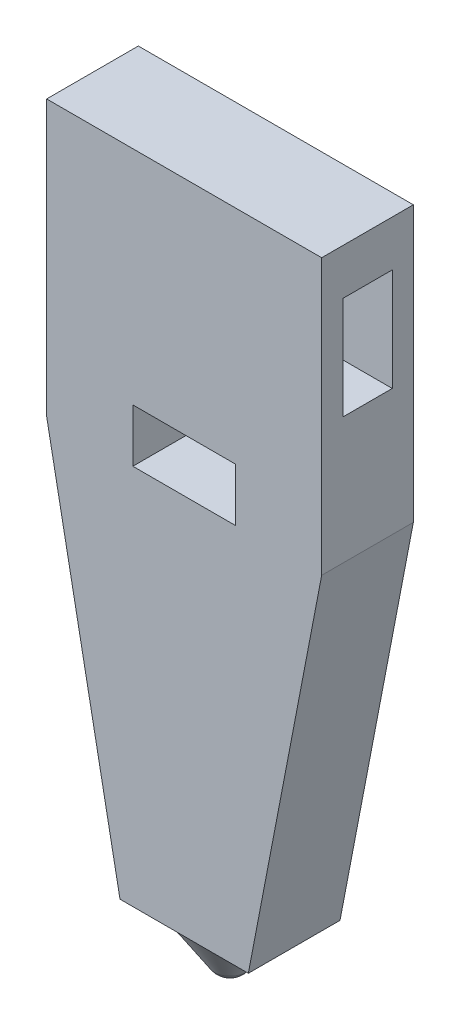
ISO-10303-21;
HEADER;
FILE_DESCRIPTION(('STEP AP214'),'2;1');
FILE_NAME('part.step','',(''),(''),'','','');
FILE_SCHEMA(('AUTOMOTIVE_DESIGN { 1 0 10303 214 1 1 1 1 }'));
ENDSEC;
DATA;
#1=APPLICATION_CONTEXT('core data for automotive mechanical design processes');
#2=APPLICATION_PROTOCOL_DEFINITION('international standard','automotive_design',2000,#1);
#3=PRODUCT_CONTEXT('',#1,'mechanical');
#4=PRODUCT('Part','Part','',(#3));
#5=PRODUCT_RELATED_PRODUCT_CATEGORY('part','',(#4));
#6=PRODUCT_DEFINITION_FORMATION('','',#4);
#7=PRODUCT_DEFINITION_CONTEXT('part definition',#1,'design');
#8=PRODUCT_DEFINITION('design','',#6,#7);
#9=PRODUCT_DEFINITION_SHAPE('','',#8);
#10=(LENGTH_UNIT() NAMED_UNIT(*) SI_UNIT(.MILLI.,.METRE.));
#11=(NAMED_UNIT(*) PLANE_ANGLE_UNIT() SI_UNIT($,.RADIAN.));
#12=(NAMED_UNIT(*) SI_UNIT($,.STERADIAN.) SOLID_ANGLE_UNIT());
#13=UNCERTAINTY_MEASURE_WITH_UNIT(LENGTH_MEASURE(1.E-05),#10,'distance_accuracy_value','');
#14=(GEOMETRIC_REPRESENTATION_CONTEXT(3) GLOBAL_UNCERTAINTY_ASSIGNED_CONTEXT((#13)) GLOBAL_UNIT_ASSIGNED_CONTEXT((#10,
#11,#12)) REPRESENTATION_CONTEXT('',''));
#15=CARTESIAN_POINT('',(0.,0.,0.));
#16=DIRECTION('',(0.,0.,1.));
#17=DIRECTION('',(1.,0.,0.));
#18=AXIS2_PLACEMENT_3D('',#15,#16,#17);
#19=CARTESIAN_POINT('',(5.08000000000001,-45.466,6.35));
#20=DIRECTION('',(0.,1.,0.));
#21=DIRECTION('',(0.,0.,1.));
#22=AXIS2_PLACEMENT_3D('',#19,#20,#21);
#23=PLANE('',#22);
#24=CARTESIAN_POINT('',(9.52500000000002,-45.466,3.175));
#25=DIRECTION('',(0.,-1.,0.));
#26=DIRECTION('',(1.,0.,0.));
#27=AXIS2_PLACEMENT_3D('',#24,#25,#26);
#28=CIRCLE('',#27,3.175);
#29=CARTESIAN_POINT('',(9.52500000000002,-45.466,6.35));
#30=VERTEX_POINT('',#29);
#31=CARTESIAN_POINT('',(9.52500000000002,-45.466,0.));
#32=VERTEX_POINT('',#31);
#33=EDGE_CURVE('E49',#30,#32,#28,.T.);
#34=ORIENTED_EDGE('',*,*,#33,.F.);
#35=DIRECTION('',(1.,0.,0.));
#36=VECTOR('',#35,1.);
#37=CARTESIAN_POINT('',(5.08000000000001,-45.466,6.35));
#38=LINE('',#37,#36);
#39=CARTESIAN_POINT('',(5.08000000000001,-45.466,6.35));
#40=VERTEX_POINT('',#39);
#41=EDGE_CURVE('E256',#40,#30,#38,.T.);
#42=ORIENTED_EDGE('',*,*,#41,.F.);
#43=DIRECTION('',(0.,0.,-1.));
#44=VECTOR('',#43,1.);
#45=CARTESIAN_POINT('',(5.08000000000001,-45.466,6.35));
#46=LINE('',#45,#44);
#47=CARTESIAN_POINT('',(5.08000000000001,-45.466,0.));
#48=VERTEX_POINT('',#47);
#49=EDGE_CURVE('E302',#40,#48,#46,.T.);
#50=ORIENTED_EDGE('',*,*,#49,.T.);
#51=DIRECTION('',(1.,0.,0.));
#52=VECTOR('',#51,1.);
#53=CARTESIAN_POINT('',(5.08000000000001,-45.466,0.));
#54=LINE('',#53,#52);
#55=EDGE_CURVE('E276',#48,#32,#54,.T.);
#56=ORIENTED_EDGE('',*,*,#55,.T.);
#57=EDGE_LOOP('',(#34,#42,#50,#56));
#58=FACE_BOUND('',#57,.T.);
#59=ADVANCED_FACE('F38',(#58),#23,.F.);
#60=CARTESIAN_POINT('',(0.,0.,6.35));
#61=DIRECTION('',(1.,0.,0.));
#62=DIRECTION('',(0.,1.,0.));
#63=AXIS2_PLACEMENT_3D('',#60,#61,#62);
#64=PLANE('',#63);
#65=DIRECTION('',(0.,0.,1.));
#66=VECTOR('',#65,1.);
#67=CARTESIAN_POINT('',(0.,-10.287,1.4605));
#68=LINE('',#67,#66);
#69=CARTESIAN_POINT('',(0.,-10.287,1.4605));
#70=VERTEX_POINT('',#69);
#71=CARTESIAN_POINT('',(0.,-10.287,4.8895));
#72=VERTEX_POINT('',#71);
#73=EDGE_CURVE('E217',#70,#72,#68,.T.);
#74=ORIENTED_EDGE('',*,*,#73,.F.);
#75=DIRECTION('',(0.,-1.,0.));
#76=VECTOR('',#75,1.);
#77=CARTESIAN_POINT('',(0.,-3.175,1.4605));
#78=LINE('',#77,#76);
#79=CARTESIAN_POINT('',(0.,-3.175,1.4605));
#80=VERTEX_POINT('',#79);
#81=EDGE_CURVE('E191',#80,#70,#78,.T.);
#82=ORIENTED_EDGE('',*,*,#81,.F.);
#83=DIRECTION('',(0.,0.,-1.));
#84=VECTOR('',#83,1.);
#85=CARTESIAN_POINT('',(0.,-3.175,1.4605));
#86=LINE('',#85,#84);
#87=CARTESIAN_POINT('',(0.,-3.175,4.8895));
#88=VERTEX_POINT('',#87);
#89=EDGE_CURVE('E202',#88,#80,#86,.T.);
#90=ORIENTED_EDGE('',*,*,#89,.F.);
#91=DIRECTION('',(0.,1.,0.));
#92=VECTOR('',#91,1.);
#93=CARTESIAN_POINT('',(0.,-3.175,4.8895));
#94=LINE('',#93,#92);
#95=EDGE_CURVE('E221',#72,#88,#94,.T.);
#96=ORIENTED_EDGE('',*,*,#95,.F.);
#97=EDGE_LOOP('',(#74,#82,#90,#96));
#98=FACE_BOUND('',#97,.T.);
#99=DIRECTION('',(0.,-1.,0.));
#100=VECTOR('',#99,1.);
#101=CARTESIAN_POINT('',(0.,0.,0.));
#102=LINE('',#101,#100);
#103=CARTESIAN_POINT('',(0.,0.,0.));
#104=VERTEX_POINT('',#103);
#105=CARTESIAN_POINT('',(0.,-19.05,0.));
#106=VERTEX_POINT('',#105);
#107=EDGE_CURVE('E246',#104,#106,#102,.T.);
#108=ORIENTED_EDGE('',*,*,#107,.T.);
#109=DIRECTION('',(0.,0.,-1.));
#110=VECTOR('',#109,1.);
#111=CARTESIAN_POINT('',(0.,-19.05,6.35));
#112=LINE('',#111,#110);
#113=CARTESIAN_POINT('',(0.,-19.05,6.35));
#114=VERTEX_POINT('',#113);
#115=EDGE_CURVE('E42',#114,#106,#112,.T.);
#116=ORIENTED_EDGE('',*,*,#115,.F.);
#117=DIRECTION('',(0.,-1.,0.));
#118=VECTOR('',#117,1.);
#119=CARTESIAN_POINT('',(0.,0.,6.35));
#120=LINE('',#119,#118);
#121=CARTESIAN_POINT('',(0.,0.,6.35));
#122=VERTEX_POINT('',#121);
#123=EDGE_CURVE('E247',#122,#114,#120,.T.);
#124=ORIENTED_EDGE('',*,*,#123,.F.);
#125=DIRECTION('',(0.,0.,-1.));
#126=VECTOR('',#125,1.);
#127=CARTESIAN_POINT('',(0.,0.,6.35));
#128=LINE('',#127,#126);
#129=EDGE_CURVE('E268',#122,#104,#128,.T.);
#130=ORIENTED_EDGE('',*,*,#129,.T.);
#131=EDGE_LOOP('',(#108,#116,#124,#130));
#132=FACE_BOUND('',#131,.T.);
#133=ADVANCED_FACE('F40',(#98,#132),#64,.F.);
#134=CARTESIAN_POINT('',(0.,-19.05,6.35));
#135=DIRECTION('',(0.982006446980647,0.188847393650125,0.));
#136=DIRECTION('',(-0.188847393650125,0.982006446980647,0.));
#137=AXIS2_PLACEMENT_3D('',#134,#135,#136);
#138=PLANE('',#137);
#139=DIRECTION('',(0.188847393650125,-0.982006446980647,0.));
#140=VECTOR('',#139,1.);
#141=CARTESIAN_POINT('',(0.,-19.05,0.));
#142=LINE('',#141,#140);
#143=EDGE_CURVE('E272',#106,#48,#142,.T.);
#144=ORIENTED_EDGE('',*,*,#143,.T.);
#145=ORIENTED_EDGE('',*,*,#49,.F.);
#146=DIRECTION('',(0.188847393650125,-0.982006446980647,0.));
#147=VECTOR('',#146,1.);
#148=CARTESIAN_POINT('',(0.,-19.05,6.35));
#149=LINE('',#148,#147);
#150=EDGE_CURVE('E251',#114,#40,#149,.T.);
#151=ORIENTED_EDGE('',*,*,#150,.F.);
#152=ORIENTED_EDGE('',*,*,#115,.T.);
#153=EDGE_LOOP('',(#144,#145,#151,#152));
#154=FACE_BOUND('',#153,.T.);
#155=ADVANCED_FACE('F313',(#154),#138,.F.);
#156=EDGE_CURVE('E11',#32,#30,#28,.T.);
#157=ORIENTED_EDGE('',*,*,#156,.F.);
#158=CARTESIAN_POINT('',(13.97,-45.466,0.));
#159=VERTEX_POINT('',#158);
#160=EDGE_CURVE('E275',#32,#159,#54,.T.);
#161=ORIENTED_EDGE('',*,*,#160,.T.);
#162=DIRECTION('',(0.,0.,-1.));
#163=VECTOR('',#162,1.);
#164=CARTESIAN_POINT('',(13.97,-45.466,6.35));
#165=LINE('',#164,#163);
#166=CARTESIAN_POINT('',(13.97,-45.466,6.35));
#167=VERTEX_POINT('',#166);
#168=EDGE_CURVE('E299',#167,#159,#165,.T.);
#169=ORIENTED_EDGE('',*,*,#168,.F.);
#170=EDGE_CURVE('E255',#30,#167,#38,.T.);
#171=ORIENTED_EDGE('',*,*,#170,.F.);
#172=EDGE_LOOP('',(#157,#161,#169,#171));
#173=FACE_BOUND('',#172,.T.);
#174=ADVANCED_FACE('F328',(#173),#23,.F.);
#175=CARTESIAN_POINT('',(13.97,-45.466,6.35));
#176=DIRECTION('',(-0.982006446980647,0.188847393650124,0.));
#177=DIRECTION('',(-0.188847393650125,-0.982006446980648,0.));
#178=AXIS2_PLACEMENT_3D('',#175,#176,#177);
#179=PLANE('',#178);
#180=DIRECTION('',(0.188847393650124,0.982006446980647,0.));
#181=VECTOR('',#180,1.);
#182=CARTESIAN_POINT('',(13.97,-45.466,0.));
#183=LINE('',#182,#181);
#184=CARTESIAN_POINT('',(19.05,-19.05,0.));
#185=VERTEX_POINT('',#184);
#186=EDGE_CURVE('E280',#159,#185,#183,.T.);
#187=ORIENTED_EDGE('',*,*,#186,.T.);
#188=DIRECTION('',(0.,0.,-1.));
#189=VECTOR('',#188,1.);
#190=CARTESIAN_POINT('',(19.05,-19.05,6.35));
#191=LINE('',#190,#189);
#192=CARTESIAN_POINT('',(19.05,-19.05,6.35));
#193=VERTEX_POINT('',#192);
#194=EDGE_CURVE('E295',#193,#185,#191,.T.);
#195=ORIENTED_EDGE('',*,*,#194,.F.);
#196=DIRECTION('',(0.188847393650124,0.982006446980647,0.));
#197=VECTOR('',#196,1.);
#198=CARTESIAN_POINT('',(13.97,-45.466,6.35));
#199=LINE('',#198,#197);
#200=EDGE_CURVE('E259',#167,#193,#199,.T.);
#201=ORIENTED_EDGE('',*,*,#200,.F.);
#202=ORIENTED_EDGE('',*,*,#168,.T.);
#203=EDGE_LOOP('',(#187,#195,#201,#202));
#204=FACE_BOUND('',#203,.T.);
#205=ADVANCED_FACE('F344',(#204),#179,.F.);
#206=CARTESIAN_POINT('',(19.05,0.,6.35));
#207=DIRECTION('',(-1.,0.,0.));
#208=DIRECTION('',(0.,-1.,0.));
#209=AXIS2_PLACEMENT_3D('',#206,#207,#208);
#210=PLANE('',#209);
#211=DIRECTION('',(0.,0.,-1.));
#212=VECTOR('',#211,1.);
#213=CARTESIAN_POINT('',(19.05,-3.175,1.4605));
#214=LINE('',#213,#212);
#215=CARTESIAN_POINT('',(19.05,-3.175,4.8895));
#216=VERTEX_POINT('',#215);
#217=CARTESIAN_POINT('',(19.05,-3.175,1.4605));
#218=VERTEX_POINT('',#217);
#219=EDGE_CURVE('E210',#216,#218,#214,.T.);
#220=ORIENTED_EDGE('',*,*,#219,.T.);
#221=DIRECTION('',(0.,-1.,0.));
#222=VECTOR('',#221,1.);
#223=CARTESIAN_POINT('',(19.05,-3.175,1.4605));
#224=LINE('',#223,#222);
#225=CARTESIAN_POINT('',(19.05,-10.287,1.4605));
#226=VERTEX_POINT('',#225);
#227=EDGE_CURVE('E197',#218,#226,#224,.T.);
#228=ORIENTED_EDGE('',*,*,#227,.T.);
#229=DIRECTION('',(0.,0.,1.));
#230=VECTOR('',#229,1.);
#231=CARTESIAN_POINT('',(19.05,-10.287,1.4605));
#232=LINE('',#231,#230);
#233=CARTESIAN_POINT('',(19.05,-10.287,4.8895));
#234=VERTEX_POINT('',#233);
#235=EDGE_CURVE('E201',#226,#234,#232,.T.);
#236=ORIENTED_EDGE('',*,*,#235,.T.);
#237=DIRECTION('',(0.,1.,0.));
#238=VECTOR('',#237,1.);
#239=CARTESIAN_POINT('',(19.05,-3.175,4.8895));
#240=LINE('',#239,#238);
#241=EDGE_CURVE('E206',#234,#216,#240,.T.);
#242=ORIENTED_EDGE('',*,*,#241,.T.);
#243=EDGE_LOOP('',(#220,#228,#236,#242));
#244=FACE_BOUND('',#243,.T.);
#245=DIRECTION('',(0.,1.,0.));
#246=VECTOR('',#245,1.);
#247=CARTESIAN_POINT('',(19.05,0.,0.));
#248=LINE('',#247,#246);
#249=CARTESIAN_POINT('',(19.05,0.,0.));
#250=VERTEX_POINT('',#249);
#251=EDGE_CURVE('E283',#185,#250,#248,.T.);
#252=ORIENTED_EDGE('',*,*,#251,.T.);
#253=DIRECTION('',(0.,0.,-1.));
#254=VECTOR('',#253,1.);
#255=CARTESIAN_POINT('',(19.05,0.,6.35));
#256=LINE('',#255,#254);
#257=CARTESIAN_POINT('',(19.05,0.,6.35));
#258=VERTEX_POINT('',#257);
#259=EDGE_CURVE('E291',#258,#250,#256,.T.);
#260=ORIENTED_EDGE('',*,*,#259,.F.);
#261=DIRECTION('',(0.,1.,0.));
#262=VECTOR('',#261,1.);
#263=CARTESIAN_POINT('',(19.05,0.,6.35));
#264=LINE('',#263,#262);
#265=EDGE_CURVE('E262',#193,#258,#264,.T.);
#266=ORIENTED_EDGE('',*,*,#265,.F.);
#267=ORIENTED_EDGE('',*,*,#194,.T.);
#268=EDGE_LOOP('',(#252,#260,#266,#267));
#269=FACE_BOUND('',#268,.T.);
#270=ADVANCED_FACE('F342',(#244,#269),#210,.F.);
#271=CARTESIAN_POINT('',(0.,0.,6.35));
#272=DIRECTION('',(0.,-1.,0.));
#273=DIRECTION('',(1.,0.,0.));
#274=AXIS2_PLACEMENT_3D('',#271,#272,#273);
#275=PLANE('',#274);
#276=DIRECTION('',(-1.,0.,0.));
#277=VECTOR('',#276,1.);
#278=CARTESIAN_POINT('',(0.,0.,0.));
#279=LINE('',#278,#277);
#280=EDGE_CURVE('E252',#250,#104,#279,.T.);
#281=ORIENTED_EDGE('',*,*,#280,.T.);
#282=ORIENTED_EDGE('',*,*,#129,.F.);
#283=DIRECTION('',(-1.,0.,0.));
#284=VECTOR('',#283,1.);
#285=CARTESIAN_POINT('',(0.,0.,6.35));
#286=LINE('',#285,#284);
#287=EDGE_CURVE('E265',#258,#122,#286,.T.);
#288=ORIENTED_EDGE('',*,*,#287,.F.);
#289=ORIENTED_EDGE('',*,*,#259,.T.);
#290=EDGE_LOOP('',(#281,#282,#288,#289));
#291=FACE_BOUND('',#290,.T.);
#292=ADVANCED_FACE('F340',(#291),#275,.F.);
#293=CARTESIAN_POINT('',(0.,0.,6.35));
#294=DIRECTION('',(0.,0.,1.));
#295=DIRECTION('',(1.,0.,0.));
#296=AXIS2_PLACEMENT_3D('',#293,#294,#295);
#297=PLANE('',#296);
#298=DIRECTION('',(0.,-1.,0.));
#299=VECTOR('',#298,1.);
#300=CARTESIAN_POINT('',(5.969,-19.05,6.35));
#301=LINE('',#300,#299);
#302=CARTESIAN_POINT('',(5.969,-15.367,6.35));
#303=VERTEX_POINT('',#302);
#304=CARTESIAN_POINT('',(5.969,-19.05,6.35));
#305=VERTEX_POINT('',#304);
#306=EDGE_CURVE('E56',#303,#305,#301,.T.);
#307=ORIENTED_EDGE('',*,*,#306,.F.);
#308=DIRECTION('',(-1.,0.,0.));
#309=VECTOR('',#308,1.);
#310=CARTESIAN_POINT('',(5.969,-15.367,6.35));
#311=LINE('',#310,#309);
#312=CARTESIAN_POINT('',(13.081,-15.367,6.35));
#313=VERTEX_POINT('',#312);
#314=EDGE_CURVE('E169',#313,#303,#311,.T.);
#315=ORIENTED_EDGE('',*,*,#314,.F.);
#316=DIRECTION('',(0.,1.,0.));
#317=VECTOR('',#316,1.);
#318=CARTESIAN_POINT('',(13.081,-19.05,6.35));
#319=LINE('',#318,#317);
#320=CARTESIAN_POINT('',(13.081,-19.05,6.35));
#321=VERTEX_POINT('',#320);
#322=EDGE_CURVE('E173',#321,#313,#319,.T.);
#323=ORIENTED_EDGE('',*,*,#322,.F.);
#324=DIRECTION('',(1.,0.,0.));
#325=VECTOR('',#324,1.);
#326=CARTESIAN_POINT('',(5.969,-19.05,6.35));
#327=LINE('',#326,#325);
#328=EDGE_CURVE('E182',#305,#321,#327,.T.);
#329=ORIENTED_EDGE('',*,*,#328,.F.);
#330=EDGE_LOOP('',(#307,#315,#323,#329));
#331=FACE_BOUND('',#330,.T.);
#332=ORIENTED_EDGE('',*,*,#123,.T.);
#333=ORIENTED_EDGE('',*,*,#150,.T.);
#334=ORIENTED_EDGE('',*,*,#41,.T.);
#335=ORIENTED_EDGE('',*,*,#170,.T.);
#336=ORIENTED_EDGE('',*,*,#200,.T.);
#337=ORIENTED_EDGE('',*,*,#265,.T.);
#338=ORIENTED_EDGE('',*,*,#287,.T.);
#339=EDGE_LOOP('',(#332,#333,#334,#335,#336,#337,#338));
#340=FACE_BOUND('',#339,.T.);
#341=ADVANCED_FACE('F334',(#331,#340),#297,.T.);
#342=CARTESIAN_POINT('',(0.,0.,0.));
#343=DIRECTION('',(0.,0.,1.));
#344=DIRECTION('',(1.,0.,0.));
#345=AXIS2_PLACEMENT_3D('',#342,#343,#344);
#346=PLANE('',#345);
#347=DIRECTION('',(-1.,0.,0.));
#348=VECTOR('',#347,1.);
#349=CARTESIAN_POINT('',(5.969,-15.367,0.));
#350=LINE('',#349,#348);
#351=CARTESIAN_POINT('',(13.081,-15.367,0.));
#352=VERTEX_POINT('',#351);
#353=CARTESIAN_POINT('',(5.969,-15.367,0.));
#354=VERTEX_POINT('',#353);
#355=EDGE_CURVE('E157',#352,#354,#350,.T.);
#356=ORIENTED_EDGE('',*,*,#355,.T.);
#357=DIRECTION('',(0.,-1.,0.));
#358=VECTOR('',#357,1.);
#359=CARTESIAN_POINT('',(5.969,-19.05,0.));
#360=LINE('',#359,#358);
#361=CARTESIAN_POINT('',(5.969,-19.05,0.));
#362=VERTEX_POINT('',#361);
#363=EDGE_CURVE('E150',#354,#362,#360,.T.);
#364=ORIENTED_EDGE('',*,*,#363,.T.);
#365=DIRECTION('',(1.,0.,0.));
#366=VECTOR('',#365,1.);
#367=CARTESIAN_POINT('',(5.969,-19.05,0.));
#368=LINE('',#367,#366);
#369=CARTESIAN_POINT('',(13.081,-19.05,0.));
#370=VERTEX_POINT('',#369);
#371=EDGE_CURVE('E160',#362,#370,#368,.T.);
#372=ORIENTED_EDGE('',*,*,#371,.T.);
#373=DIRECTION('',(0.,1.,0.));
#374=VECTOR('',#373,1.);
#375=CARTESIAN_POINT('',(13.081,-19.05,0.));
#376=LINE('',#375,#374);
#377=EDGE_CURVE('E64',#370,#352,#376,.T.);
#378=ORIENTED_EDGE('',*,*,#377,.T.);
#379=EDGE_LOOP('',(#356,#364,#372,#378));
#380=FACE_BOUND('',#379,.T.);
#381=ORIENTED_EDGE('',*,*,#107,.F.);
#382=ORIENTED_EDGE('',*,*,#280,.F.);
#383=ORIENTED_EDGE('',*,*,#251,.F.);
#384=ORIENTED_EDGE('',*,*,#186,.F.);
#385=ORIENTED_EDGE('',*,*,#160,.F.);
#386=ORIENTED_EDGE('',*,*,#55,.F.);
#387=ORIENTED_EDGE('',*,*,#143,.F.);
#388=EDGE_LOOP('',(#381,#382,#383,#384,#385,#386,#387));
#389=FACE_BOUND('',#388,.T.);
#390=ADVANCED_FACE('F165',(#380,#389),#346,.F.);
#391=CARTESIAN_POINT('',(9.52500000000001,-48.7002815138389,3.175));
#392=DIRECTION('',(0.,1.,0.));
#393=DIRECTION('',(-1.,0.,0.));
#394=AXIS2_PLACEMENT_3D('',#391,#392,#393);
#395=CONICAL_SURFACE('',#394,1.0634252110711,0.578392191589083);
#396=ORIENTED_EDGE('',*,*,#33,.T.);
#397=ORIENTED_EDGE('',*,*,#156,.T.);
#398=EDGE_LOOP('',(#396,#397));
#399=FACE_BOUND('',#398,.T.);
#400=CARTESIAN_POINT('',(9.52500000000001,-48.7002815138389,3.175));
#401=DIRECTION('',(0.,-1.,0.));
#402=DIRECTION('',(1.,0.,0.));
#403=AXIS2_PLACEMENT_3D('',#400,#401,#402);
#404=CIRCLE('',#403,1.0634252110711);
#405=CARTESIAN_POINT('',(10.5884252110711,-48.7002815138389,3.175));
#406=VERTEX_POINT('',#405);
#407=EDGE_CURVE('E231',#406,#406,#404,.T.);
#408=ORIENTED_EDGE('',*,*,#407,.F.);
#409=EDGE_LOOP('',(#408));
#410=FACE_BOUND('',#409,.T.);
#411=ADVANCED_FACE('F324',(#399,#410),#395,.T.);
#412=CARTESIAN_POINT('',(9.52500000000001,-48.006,3.175));
#413=DIRECTION('',(0.,-1.,0.));
#414=DIRECTION('',(1.,0.,0.));
#415=AXIS2_PLACEMENT_3D('',#412,#413,#414);
#416=SPHERICAL_SURFACE('',#415,1.27);
#417=ORIENTED_EDGE('',*,*,#407,.T.);
#418=EDGE_LOOP('',(#417));
#419=FACE_BOUND('',#418,.T.);
#420=ADVANCED_FACE('F381',(#419),#416,.T.);
#421=CARTESIAN_POINT('',(19.05,-3.175,1.4605));
#422=DIRECTION('',(0.,0.,-1.));
#423=DIRECTION('',(0.,1.,0.));
#424=AXIS2_PLACEMENT_3D('',#421,#422,#423);
#425=PLANE('',#424);
#426=ORIENTED_EDGE('',*,*,#81,.T.);
#427=DIRECTION('',(-1.,0.,0.));
#428=VECTOR('',#427,1.);
#429=CARTESIAN_POINT('',(19.05,-10.287,1.4605));
#430=LINE('',#429,#428);
#431=EDGE_CURVE('E214',#226,#70,#430,.T.);
#432=ORIENTED_EDGE('',*,*,#431,.F.);
#433=ORIENTED_EDGE('',*,*,#227,.F.);
#434=DIRECTION('',(-1.,0.,0.));
#435=VECTOR('',#434,1.);
#436=CARTESIAN_POINT('',(19.05,-3.175,1.4605));
#437=LINE('',#436,#435);
#438=EDGE_CURVE('E228',#218,#80,#437,.T.);
#439=ORIENTED_EDGE('',*,*,#438,.T.);
#440=EDGE_LOOP('',(#426,#432,#433,#439));
#441=FACE_BOUND('',#440,.T.);
#442=ADVANCED_FACE('F390',(#441),#425,.F.);
#443=CARTESIAN_POINT('',(19.05,-3.175,1.4605));
#444=DIRECTION('',(0.,1.,0.));
#445=DIRECTION('',(0.,0.,1.));
#446=AXIS2_PLACEMENT_3D('',#443,#444,#445);
#447=PLANE('',#446);
#448=ORIENTED_EDGE('',*,*,#89,.T.);
#449=ORIENTED_EDGE('',*,*,#438,.F.);
#450=ORIENTED_EDGE('',*,*,#219,.F.);
#451=DIRECTION('',(-1.,0.,0.));
#452=VECTOR('',#451,1.);
#453=CARTESIAN_POINT('',(19.05,-3.175,4.8895));
#454=LINE('',#453,#452);
#455=EDGE_CURVE('E232',#216,#88,#454,.T.);
#456=ORIENTED_EDGE('',*,*,#455,.T.);
#457=EDGE_LOOP('',(#448,#449,#450,#456));
#458=FACE_BOUND('',#457,.T.);
#459=ADVANCED_FACE('F413',(#458),#447,.F.);
#460=CARTESIAN_POINT('',(19.05,-3.175,4.8895));
#461=DIRECTION('',(0.,0.,1.));
#462=DIRECTION('',(0.,-1.,0.));
#463=AXIS2_PLACEMENT_3D('',#460,#461,#462);
#464=PLANE('',#463);
#465=ORIENTED_EDGE('',*,*,#95,.T.);
#466=ORIENTED_EDGE('',*,*,#455,.F.);
#467=ORIENTED_EDGE('',*,*,#241,.F.);
#468=DIRECTION('',(-1.,0.,0.));
#469=VECTOR('',#468,1.);
#470=CARTESIAN_POINT('',(19.05,-10.287,4.8895));
#471=LINE('',#470,#469);
#472=EDGE_CURVE('E235',#234,#72,#471,.T.);
#473=ORIENTED_EDGE('',*,*,#472,.T.);
#474=EDGE_LOOP('',(#465,#466,#467,#473));
#475=FACE_BOUND('',#474,.T.);
#476=ADVANCED_FACE('F423',(#475),#464,.F.);
#477=CARTESIAN_POINT('',(19.05,-10.287,1.4605));
#478=DIRECTION('',(0.,-1.,0.));
#479=DIRECTION('',(0.,0.,-1.));
#480=AXIS2_PLACEMENT_3D('',#477,#478,#479);
#481=PLANE('',#480);
#482=ORIENTED_EDGE('',*,*,#73,.T.);
#483=ORIENTED_EDGE('',*,*,#472,.F.);
#484=ORIENTED_EDGE('',*,*,#235,.F.);
#485=ORIENTED_EDGE('',*,*,#431,.T.);
#486=EDGE_LOOP('',(#482,#483,#484,#485));
#487=FACE_BOUND('',#486,.T.);
#488=ADVANCED_FACE('F433',(#487),#481,.F.);
#489=CARTESIAN_POINT('',(5.969,-19.05,0.));
#490=DIRECTION('',(-1.,0.,0.));
#491=DIRECTION('',(0.,-1.,0.));
#492=AXIS2_PLACEMENT_3D('',#489,#490,#491);
#493=PLANE('',#492);
#494=ORIENTED_EDGE('',*,*,#306,.T.);
#495=DIRECTION('',(0.,0.,1.));
#496=VECTOR('',#495,1.);
#497=CARTESIAN_POINT('',(5.969,-19.05,0.));
#498=LINE('',#497,#496);
#499=EDGE_CURVE('E146',#362,#305,#498,.T.);
#500=ORIENTED_EDGE('',*,*,#499,.F.);
#501=ORIENTED_EDGE('',*,*,#363,.F.);
#502=DIRECTION('',(0.,0.,1.));
#503=VECTOR('',#502,1.);
#504=CARTESIAN_POINT('',(5.969,-15.367,0.));
#505=LINE('',#504,#503);
#506=EDGE_CURVE('E188',#354,#303,#505,.T.);
#507=ORIENTED_EDGE('',*,*,#506,.T.);
#508=EDGE_LOOP('',(#494,#500,#501,#507));
#509=FACE_BOUND('',#508,.T.);
#510=ADVANCED_FACE('F148',(#509),#493,.F.);
#511=CARTESIAN_POINT('',(5.969,-15.367,0.));
#512=DIRECTION('',(0.,1.,0.));
#513=DIRECTION('',(0.,0.,1.));
#514=AXIS2_PLACEMENT_3D('',#511,#512,#513);
#515=PLANE('',#514);
#516=ORIENTED_EDGE('',*,*,#314,.T.);
#517=ORIENTED_EDGE('',*,*,#506,.F.);
#518=ORIENTED_EDGE('',*,*,#355,.F.);
#519=DIRECTION('',(0.,0.,1.));
#520=VECTOR('',#519,1.);
#521=CARTESIAN_POINT('',(13.081,-15.367,0.));
#522=LINE('',#521,#520);
#523=EDGE_CURVE('E192',#352,#313,#522,.T.);
#524=ORIENTED_EDGE('',*,*,#523,.T.);
#525=EDGE_LOOP('',(#516,#517,#518,#524));
#526=FACE_BOUND('',#525,.T.);
#527=ADVANCED_FACE('F464',(#526),#515,.F.);
#528=CARTESIAN_POINT('',(13.081,-19.05,0.));
#529=DIRECTION('',(1.,0.,0.));
#530=DIRECTION('',(0.,1.,0.));
#531=AXIS2_PLACEMENT_3D('',#528,#529,#530);
#532=PLANE('',#531);
#533=ORIENTED_EDGE('',*,*,#322,.T.);
#534=ORIENTED_EDGE('',*,*,#523,.F.);
#535=ORIENTED_EDGE('',*,*,#377,.F.);
#536=DIRECTION('',(0.,0.,1.));
#537=VECTOR('',#536,1.);
#538=CARTESIAN_POINT('',(13.081,-19.05,0.));
#539=LINE('',#538,#537);
#540=EDGE_CURVE('E156',#370,#321,#539,.T.);
#541=ORIENTED_EDGE('',*,*,#540,.T.);
#542=EDGE_LOOP('',(#533,#534,#535,#541));
#543=FACE_BOUND('',#542,.T.);
#544=ADVANCED_FACE('F473',(#543),#532,.F.);
#545=CARTESIAN_POINT('',(5.969,-19.05,0.));
#546=DIRECTION('',(0.,-1.,0.));
#547=DIRECTION('',(0.,0.,-1.));
#548=AXIS2_PLACEMENT_3D('',#545,#546,#547);
#549=PLANE('',#548);
#550=ORIENTED_EDGE('',*,*,#328,.T.);
#551=ORIENTED_EDGE('',*,*,#540,.F.);
#552=ORIENTED_EDGE('',*,*,#371,.F.);
#553=ORIENTED_EDGE('',*,*,#499,.T.);
#554=EDGE_LOOP('',(#550,#551,#552,#553));
#555=FACE_BOUND('',#554,.T.);
#556=ADVANCED_FACE('F161',(#555),#549,.F.);
#557=CLOSED_SHELL('',(#59,#133,#155,#174,#205,#270,#292,#341,#390,#411,#420,#442,#459,#476,#488,
#510,#527,#544,#556));
#558=MANIFOLD_SOLID_BREP('B2',#557);
#559=ADVANCED_BREP_SHAPE_REPRESENTATION('',(#18,#558),#14);
#560=SHAPE_DEFINITION_REPRESENTATION(#9,#559);
ENDSEC;
END-ISO-10303-21;
